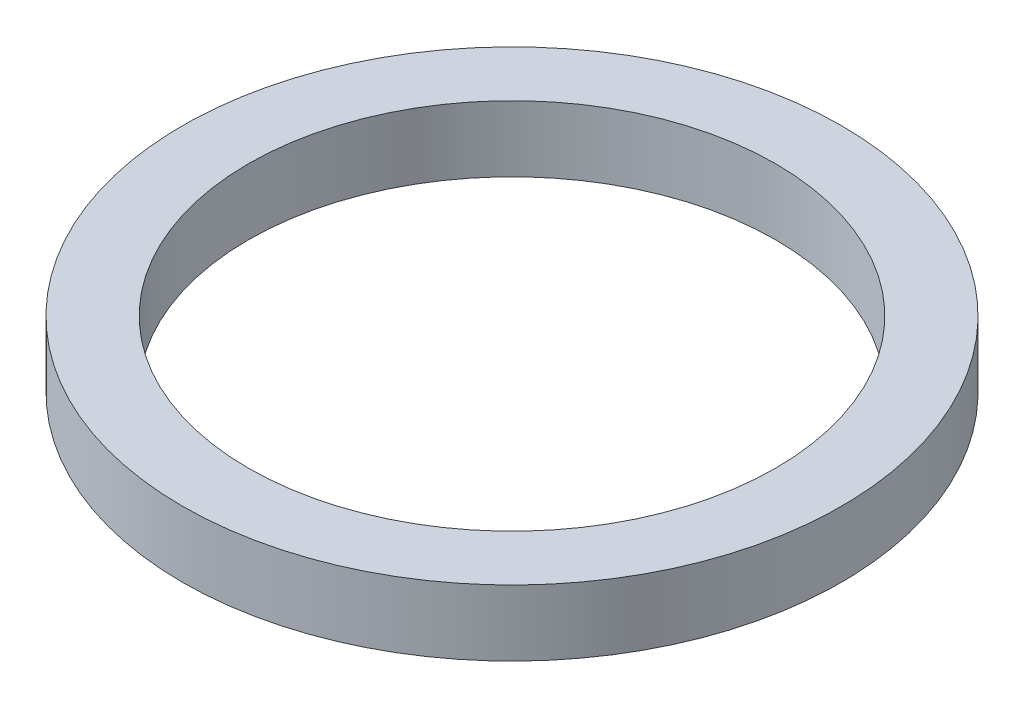
ISO-10303-21;
HEADER;
FILE_DESCRIPTION(('STEP AP214'),'2;1');
FILE_NAME('part.step','',(''),(''),'','','');
FILE_SCHEMA(('AUTOMOTIVE_DESIGN { 1 0 10303 214 1 1 1 1 }'));
ENDSEC;
DATA;
#1=APPLICATION_CONTEXT('core data for automotive mechanical design processes');
#2=APPLICATION_PROTOCOL_DEFINITION('international standard','automotive_design',2000,#1);
#3=PRODUCT_CONTEXT('',#1,'mechanical');
#4=PRODUCT('Part','Part','',(#3));
#5=PRODUCT_RELATED_PRODUCT_CATEGORY('part','',(#4));
#6=PRODUCT_DEFINITION_FORMATION('','',#4);
#7=PRODUCT_DEFINITION_CONTEXT('part definition',#1,'design');
#8=PRODUCT_DEFINITION('design','',#6,#7);
#9=PRODUCT_DEFINITION_SHAPE('','',#8);
#10=(LENGTH_UNIT() NAMED_UNIT(*) SI_UNIT(.MILLI.,.METRE.));
#11=(NAMED_UNIT(*) PLANE_ANGLE_UNIT() SI_UNIT($,.RADIAN.));
#12=(NAMED_UNIT(*) SI_UNIT($,.STERADIAN.) SOLID_ANGLE_UNIT());
#13=UNCERTAINTY_MEASURE_WITH_UNIT(LENGTH_MEASURE(1.E-05),#10,'distance_accuracy_value','');
#14=(GEOMETRIC_REPRESENTATION_CONTEXT(3) GLOBAL_UNCERTAINTY_ASSIGNED_CONTEXT((#13)) GLOBAL_UNIT_ASSIGNED_CONTEXT((#10,
#11,#12)) REPRESENTATION_CONTEXT('',''));
#15=CARTESIAN_POINT('',(0.,0.,0.));
#16=DIRECTION('',(0.,0.,1.));
#17=DIRECTION('',(1.,0.,0.));
#18=AXIS2_PLACEMENT_3D('',#15,#16,#17);
#19=CARTESIAN_POINT('',(0.,4.,0.));
#20=DIRECTION('',(0.,1.,0.));
#21=DIRECTION('',(0.,0.,1.));
#22=AXIS2_PLACEMENT_3D('',#19,#20,#21);
#23=PLANE('',#22);
#24=CARTESIAN_POINT('',(0.,4.,0.));
#25=DIRECTION('',(0.,1.,0.));
#26=DIRECTION('',(0.,0.,1.));
#27=AXIS2_PLACEMENT_3D('',#24,#25,#26);
#28=CIRCLE('',#27,20.);
#29=CARTESIAN_POINT('',(0.,4.,20.));
#30=VERTEX_POINT('',#29);
#31=EDGE_CURVE('E10',#30,#30,#28,.T.);
#32=ORIENTED_EDGE('',*,*,#31,.T.);
#33=EDGE_LOOP('',(#32));
#34=FACE_BOUND('',#33,.T.);
#35=CARTESIAN_POINT('',(0.,4.,0.));
#36=DIRECTION('',(0.,1.,0.));
#37=DIRECTION('',(0.,0.,1.));
#38=AXIS2_PLACEMENT_3D('',#35,#36,#37);
#39=CIRCLE('',#38,16.);
#40=CARTESIAN_POINT('',(0.,4.,16.));
#41=VERTEX_POINT('',#40);
#42=EDGE_CURVE('E50',#41,#41,#39,.T.);
#43=ORIENTED_EDGE('',*,*,#42,.F.);
#44=EDGE_LOOP('',(#43));
#45=FACE_BOUND('',#44,.T.);
#46=ADVANCED_FACE('F37',(#34,#45),#23,.T.);
#47=CARTESIAN_POINT('',(0.,0.,0.));
#48=DIRECTION('',(0.,1.,0.));
#49=DIRECTION('',(0.,0.,1.));
#50=AXIS2_PLACEMENT_3D('',#47,#48,#49);
#51=PLANE('',#50);
#52=CARTESIAN_POINT('',(0.,0.,0.));
#53=DIRECTION('',(0.,1.,0.));
#54=DIRECTION('',(0.,0.,1.));
#55=AXIS2_PLACEMENT_3D('',#52,#53,#54);
#56=CIRCLE('',#55,20.);
#57=CARTESIAN_POINT('',(0.,0.,20.));
#58=VERTEX_POINT('',#57);
#59=EDGE_CURVE('E41',#58,#58,#56,.T.);
#60=ORIENTED_EDGE('',*,*,#59,.F.);
#61=EDGE_LOOP('',(#60));
#62=FACE_BOUND('',#61,.T.);
#63=CARTESIAN_POINT('',(0.,0.,0.));
#64=DIRECTION('',(0.,1.,0.));
#65=DIRECTION('',(0.,0.,1.));
#66=AXIS2_PLACEMENT_3D('',#63,#64,#65);
#67=CIRCLE('',#66,16.);
#68=CARTESIAN_POINT('',(0.,0.,16.));
#69=VERTEX_POINT('',#68);
#70=EDGE_CURVE('E52',#69,#69,#67,.T.);
#71=ORIENTED_EDGE('',*,*,#70,.T.);
#72=EDGE_LOOP('',(#71));
#73=FACE_BOUND('',#72,.T.);
#74=ADVANCED_FACE('F64',(#62,#73),#51,.F.);
#75=CARTESIAN_POINT('',(0.,4.,0.));
#76=DIRECTION('',(0.,-1.,0.));
#77=DIRECTION('',(0.,0.,-1.));
#78=AXIS2_PLACEMENT_3D('',#75,#76,#77);
#79=CYLINDRICAL_SURFACE('',#78,20.);
#80=ORIENTED_EDGE('',*,*,#31,.F.);
#81=EDGE_LOOP('',(#80));
#82=FACE_BOUND('',#81,.T.);
#83=ORIENTED_EDGE('',*,*,#59,.T.);
#84=EDGE_LOOP('',(#83));
#85=FACE_BOUND('',#84,.T.);
#86=ADVANCED_FACE('F39',(#82,#85),#79,.T.);
#87=CARTESIAN_POINT('',(0.,4.,0.));
#88=DIRECTION('',(0.,-1.,0.));
#89=DIRECTION('',(0.,0.,-1.));
#90=AXIS2_PLACEMENT_3D('',#87,#88,#89);
#91=CYLINDRICAL_SURFACE('',#90,16.);
#92=ORIENTED_EDGE('',*,*,#42,.T.);
#93=EDGE_LOOP('',(#92));
#94=FACE_BOUND('',#93,.T.);
#95=ORIENTED_EDGE('',*,*,#70,.F.);
#96=EDGE_LOOP('',(#95));
#97=FACE_BOUND('',#96,.T.);
#98=ADVANCED_FACE('F60',(#94,#97),#91,.F.);
#99=CLOSED_SHELL('',(#46,#74,#86,#98));
#100=MANIFOLD_SOLID_BREP('B2',#99);
#101=ADVANCED_BREP_SHAPE_REPRESENTATION('',(#18,#100),#14);
#102=SHAPE_DEFINITION_REPRESENTATION(#9,#101);
ENDSEC;
END-ISO-10303-21;
